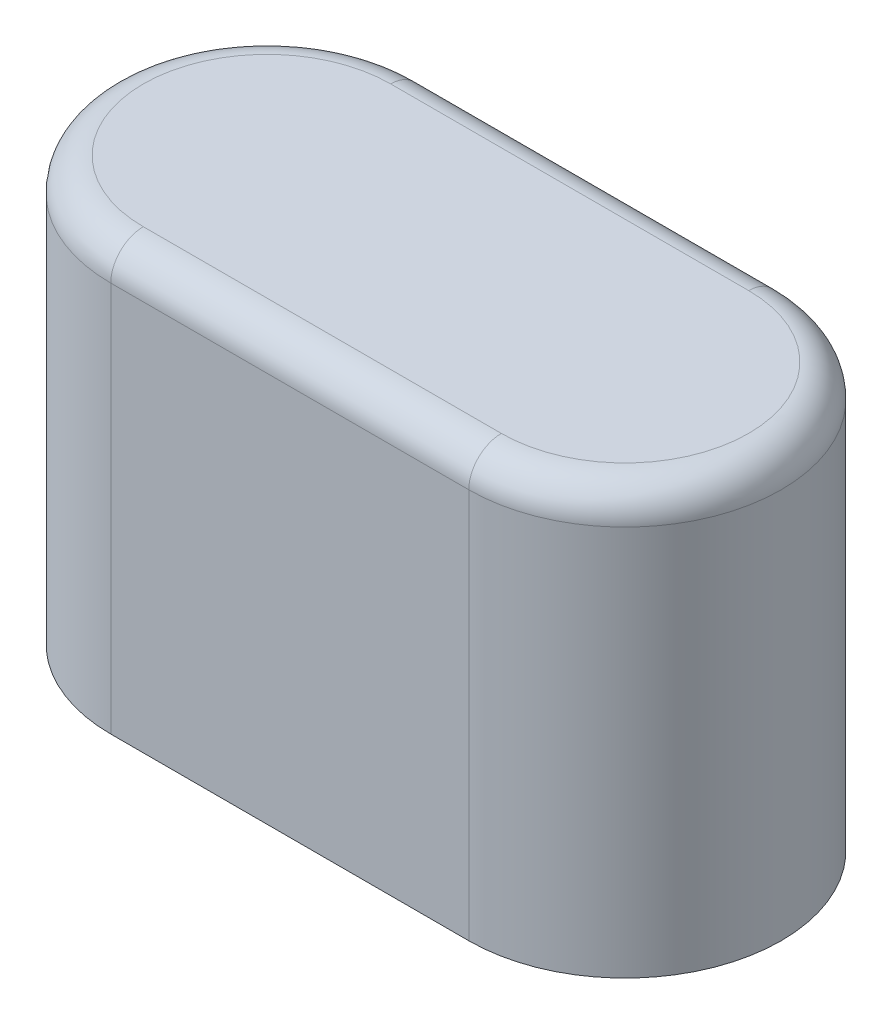
ISO-10303-21;
HEADER;
FILE_DESCRIPTION(('STEP AP214'),'2;1');
FILE_NAME('part.step','',(''),(''),'','','');
FILE_SCHEMA(('AUTOMOTIVE_DESIGN { 1 0 10303 214 1 1 1 1 }'));
ENDSEC;
DATA;
#1=APPLICATION_CONTEXT('core data for automotive mechanical design processes');
#2=APPLICATION_PROTOCOL_DEFINITION('international standard','automotive_design',2000,#1);
#3=PRODUCT_CONTEXT('',#1,'mechanical');
#4=PRODUCT('Part','Part','',(#3));
#5=PRODUCT_RELATED_PRODUCT_CATEGORY('part','',(#4));
#6=PRODUCT_DEFINITION_FORMATION('','',#4);
#7=PRODUCT_DEFINITION_CONTEXT('part definition',#1,'design');
#8=PRODUCT_DEFINITION('design','',#6,#7);
#9=PRODUCT_DEFINITION_SHAPE('','',#8);
#10=(LENGTH_UNIT() NAMED_UNIT(*) SI_UNIT(.MILLI.,.METRE.));
#11=(NAMED_UNIT(*) PLANE_ANGLE_UNIT() SI_UNIT($,.RADIAN.));
#12=(NAMED_UNIT(*) SI_UNIT($,.STERADIAN.) SOLID_ANGLE_UNIT());
#13=UNCERTAINTY_MEASURE_WITH_UNIT(LENGTH_MEASURE(1.E-05),#10,'distance_accuracy_value','');
#14=(GEOMETRIC_REPRESENTATION_CONTEXT(3) GLOBAL_UNCERTAINTY_ASSIGNED_CONTEXT((#13)) GLOBAL_UNIT_ASSIGNED_CONTEXT((#10,
#11,#12)) REPRESENTATION_CONTEXT('',''));
#15=CARTESIAN_POINT('',(0.,0.,0.));
#16=DIRECTION('',(0.,0.,1.));
#17=DIRECTION('',(1.,0.,0.));
#18=AXIS2_PLACEMENT_3D('',#15,#16,#17);
#19=CARTESIAN_POINT('',(-3.4925,8.255,0.));
#20=DIRECTION('',(0.,-1.,0.));
#21=DIRECTION('',(0.,0.,-1.));
#22=AXIS2_PLACEMENT_3D('',#19,#20,#21);
#23=CYLINDRICAL_SURFACE('',#22,3.048);
#24=DIRECTION('',(0.,-1.,0.));
#25=VECTOR('',#24,1.);
#26=CARTESIAN_POINT('',(-3.4925,8.255,3.048));
#27=LINE('',#26,#25);
#28=CARTESIAN_POINT('',(-3.4925,7.62,3.048));
#29=VERTEX_POINT('',#28);
#30=CARTESIAN_POINT('',(-3.4925,0.,3.048));
#31=VERTEX_POINT('',#30);
#32=EDGE_CURVE('E94',#29,#31,#27,.T.);
#33=ORIENTED_EDGE('',*,*,#32,.F.);
#34=CARTESIAN_POINT('',(-3.4925,7.62,0.));
#35=DIRECTION('',(0.,1.,0.));
#36=DIRECTION('',(0.,0.,1.));
#37=AXIS2_PLACEMENT_3D('',#34,#35,#36);
#38=CIRCLE('',#37,3.048);
#39=CARTESIAN_POINT('',(-3.4925,7.62,-3.048));
#40=VERTEX_POINT('',#39);
#41=EDGE_CURVE('E64',#29,#40,#38,.F.);
#42=ORIENTED_EDGE('',*,*,#41,.T.);
#43=DIRECTION('',(0.,-1.,0.));
#44=VECTOR('',#43,1.);
#45=CARTESIAN_POINT('',(-3.4925,8.255,-3.048));
#46=LINE('',#45,#44);
#47=CARTESIAN_POINT('',(-3.4925,0.,-3.048));
#48=VERTEX_POINT('',#47);
#49=EDGE_CURVE('E116',#40,#48,#46,.T.);
#50=ORIENTED_EDGE('',*,*,#49,.T.);
#51=CARTESIAN_POINT('',(-3.4925,0.,0.));
#52=DIRECTION('',(0.,1.,0.));
#53=DIRECTION('',(0.,0.,1.));
#54=AXIS2_PLACEMENT_3D('',#51,#52,#53);
#55=CIRCLE('',#54,3.048);
#56=EDGE_CURVE('E111',#48,#31,#55,.T.);
#57=ORIENTED_EDGE('',*,*,#56,.T.);
#58=EDGE_LOOP('',(#33,#42,#50,#57));
#59=FACE_BOUND('',#58,.T.);
#60=ADVANCED_FACE('F39',(#59),#23,.T.);
#61=CARTESIAN_POINT('',(-3.4925,8.255,3.048));
#62=DIRECTION('',(0.,0.,-1.));
#63=DIRECTION('',(-1.,0.,0.));
#64=AXIS2_PLACEMENT_3D('',#61,#62,#63);
#65=PLANE('',#64);
#66=DIRECTION('',(0.,-1.,0.));
#67=VECTOR('',#66,1.);
#68=CARTESIAN_POINT('',(3.4925,8.255,3.048));
#69=LINE('',#68,#67);
#70=CARTESIAN_POINT('',(3.4925,7.62,3.048));
#71=VERTEX_POINT('',#70);
#72=CARTESIAN_POINT('',(3.4925,0.,3.048));
#73=VERTEX_POINT('',#72);
#74=EDGE_CURVE('E105',#71,#73,#69,.T.);
#75=ORIENTED_EDGE('',*,*,#74,.F.);
#76=DIRECTION('',(1.,0.,0.));
#77=VECTOR('',#76,1.);
#78=CARTESIAN_POINT('',(-3.4925,7.62,3.048));
#79=LINE('',#78,#77);
#80=EDGE_CURVE('E101',#71,#29,#79,.F.);
#81=ORIENTED_EDGE('',*,*,#80,.T.);
#82=ORIENTED_EDGE('',*,*,#32,.T.);
#83=DIRECTION('',(1.,0.,0.));
#84=VECTOR('',#83,1.);
#85=CARTESIAN_POINT('',(-3.4925,0.,3.048));
#86=LINE('',#85,#84);
#87=EDGE_CURVE('E98',#31,#73,#86,.T.);
#88=ORIENTED_EDGE('',*,*,#87,.T.);
#89=EDGE_LOOP('',(#75,#81,#82,#88));
#90=FACE_BOUND('',#89,.T.);
#91=ADVANCED_FACE('F97',(#90),#65,.F.);
#92=CARTESIAN_POINT('',(3.4925,8.255,0.));
#93=DIRECTION('',(0.,-1.,0.));
#94=DIRECTION('',(0.,0.,-1.));
#95=AXIS2_PLACEMENT_3D('',#92,#93,#94);
#96=CYLINDRICAL_SURFACE('',#95,3.048);
#97=DIRECTION('',(0.,-1.,0.));
#98=VECTOR('',#97,1.);
#99=CARTESIAN_POINT('',(3.4925,8.255,-3.048));
#100=LINE('',#99,#98);
#101=CARTESIAN_POINT('',(3.4925,7.62,-3.048));
#102=VERTEX_POINT('',#101);
#103=CARTESIAN_POINT('',(3.4925,0.,-3.048));
#104=VERTEX_POINT('',#103);
#105=EDGE_CURVE('E134',#102,#104,#100,.T.);
#106=ORIENTED_EDGE('',*,*,#105,.F.);
#107=CARTESIAN_POINT('',(3.4925,7.62,0.));
#108=DIRECTION('',(0.,1.,0.));
#109=DIRECTION('',(0.,0.,1.));
#110=AXIS2_PLACEMENT_3D('',#107,#108,#109);
#111=CIRCLE('',#110,3.048);
#112=EDGE_CURVE('E11',#102,#71,#111,.F.);
#113=ORIENTED_EDGE('',*,*,#112,.T.);
#114=ORIENTED_EDGE('',*,*,#74,.T.);
#115=CARTESIAN_POINT('',(3.4925,0.,0.));
#116=DIRECTION('',(0.,1.,0.));
#117=DIRECTION('',(0.,0.,1.));
#118=AXIS2_PLACEMENT_3D('',#115,#116,#117);
#119=CIRCLE('',#118,3.048);
#120=EDGE_CURVE('E113',#73,#104,#119,.T.);
#121=ORIENTED_EDGE('',*,*,#120,.T.);
#122=EDGE_LOOP('',(#106,#113,#114,#121));
#123=FACE_BOUND('',#122,.T.);
#124=ADVANCED_FACE('F194',(#123),#96,.T.);
#125=CARTESIAN_POINT('',(-3.4925,8.255,-3.048));
#126=DIRECTION('',(0.,0.,1.));
#127=DIRECTION('',(1.,0.,0.));
#128=AXIS2_PLACEMENT_3D('',#125,#126,#127);
#129=PLANE('',#128);
#130=ORIENTED_EDGE('',*,*,#49,.F.);
#131=DIRECTION('',(-1.,0.,0.));
#132=VECTOR('',#131,1.);
#133=CARTESIAN_POINT('',(3.4925,7.62,-3.048));
#134=LINE('',#133,#132);
#135=EDGE_CURVE('E49',#40,#102,#134,.F.);
#136=ORIENTED_EDGE('',*,*,#135,.T.);
#137=ORIENTED_EDGE('',*,*,#105,.T.);
#138=DIRECTION('',(-1.,0.,0.));
#139=VECTOR('',#138,1.);
#140=CARTESIAN_POINT('',(-3.4925,0.,-3.048));
#141=LINE('',#140,#139);
#142=EDGE_CURVE('E129',#104,#48,#141,.T.);
#143=ORIENTED_EDGE('',*,*,#142,.T.);
#144=EDGE_LOOP('',(#130,#136,#137,#143));
#145=FACE_BOUND('',#144,.T.);
#146=ADVANCED_FACE('F216',(#145),#129,.F.);
#147=CARTESIAN_POINT('',(-3.4925,8.255,0.));
#148=DIRECTION('',(0.,1.,0.));
#149=DIRECTION('',(0.,0.,1.));
#150=AXIS2_PLACEMENT_3D('',#147,#148,#149);
#151=PLANE('',#150);
#152=CARTESIAN_POINT('',(-3.4925,8.255,0.));
#153=DIRECTION('',(0.,1.,0.));
#154=DIRECTION('',(0.,0.,1.));
#155=AXIS2_PLACEMENT_3D('',#152,#153,#154);
#156=CIRCLE('',#155,2.413);
#157=CARTESIAN_POINT('',(-3.4925,8.255,-2.413));
#158=VERTEX_POINT('',#157);
#159=CARTESIAN_POINT('',(-3.4925,8.255,2.413));
#160=VERTEX_POINT('',#159);
#161=EDGE_CURVE('E144',#158,#160,#156,.T.);
#162=ORIENTED_EDGE('',*,*,#161,.T.);
#163=DIRECTION('',(1.,0.,0.));
#164=VECTOR('',#163,1.);
#165=CARTESIAN_POINT('',(3.4925,8.255,2.413));
#166=LINE('',#165,#164);
#167=CARTESIAN_POINT('',(3.4925,8.255,2.413));
#168=VERTEX_POINT('',#167);
#169=EDGE_CURVE('E147',#160,#168,#166,.T.);
#170=ORIENTED_EDGE('',*,*,#169,.T.);
#171=CARTESIAN_POINT('',(3.4925,8.255,0.));
#172=DIRECTION('',(0.,1.,0.));
#173=DIRECTION('',(0.,0.,1.));
#174=AXIS2_PLACEMENT_3D('',#171,#172,#173);
#175=CIRCLE('',#174,2.413);
#176=CARTESIAN_POINT('',(3.4925,8.255,-2.413));
#177=VERTEX_POINT('',#176);
#178=EDGE_CURVE('E104',#168,#177,#175,.T.);
#179=ORIENTED_EDGE('',*,*,#178,.T.);
#180=DIRECTION('',(-1.,0.,0.));
#181=VECTOR('',#180,1.);
#182=CARTESIAN_POINT('',(-3.4925,8.255,-2.413));
#183=LINE('',#182,#181);
#184=EDGE_CURVE('E141',#177,#158,#183,.T.);
#185=ORIENTED_EDGE('',*,*,#184,.T.);
#186=EDGE_LOOP('',(#162,#170,#179,#185));
#187=FACE_BOUND('',#186,.T.);
#188=ADVANCED_FACE('F176',(#187),#151,.T.);
#189=CARTESIAN_POINT('',(-3.4925,0.,0.));
#190=DIRECTION('',(0.,1.,0.));
#191=DIRECTION('',(0.,0.,1.));
#192=AXIS2_PLACEMENT_3D('',#189,#190,#191);
#193=PLANE('',#192);
#194=CARTESIAN_POINT('',(0.,0.,0.));
#195=DIRECTION('',(0.,-1.,0.));
#196=DIRECTION('',(0.,0.,-1.));
#197=AXIS2_PLACEMENT_3D('',#194,#195,#196);
#198=CIRCLE('',#197,1.778);
#199=CARTESIAN_POINT('',(0.,0.,-1.778));
#200=VERTEX_POINT('',#199);
#201=EDGE_CURVE('E124',#200,#200,#198,.T.);
#202=ORIENTED_EDGE('',*,*,#201,.F.);
#203=EDGE_LOOP('',(#202));
#204=FACE_BOUND('',#203,.T.);
#205=ORIENTED_EDGE('',*,*,#56,.F.);
#206=ORIENTED_EDGE('',*,*,#142,.F.);
#207=ORIENTED_EDGE('',*,*,#120,.F.);
#208=ORIENTED_EDGE('',*,*,#87,.F.);
#209=EDGE_LOOP('',(#205,#206,#207,#208));
#210=FACE_BOUND('',#209,.T.);
#211=ADVANCED_FACE('F109',(#204,#210),#193,.F.);
#212=CARTESIAN_POINT('',(-3.4925,7.62,-2.413));
#213=DIRECTION('',(1.,0.,0.));
#214=DIRECTION('',(0.,0.,-1.));
#215=AXIS2_PLACEMENT_3D('',#212,#213,#214);
#216=CYLINDRICAL_SURFACE('',#215,0.635);
#217=CARTESIAN_POINT('',(3.4925,7.62,-2.413));
#218=DIRECTION('',(1.,0.,0.));
#219=DIRECTION('',(0.,0.,-1.));
#220=AXIS2_PLACEMENT_3D('',#217,#218,#219);
#221=CIRCLE('',#220,0.635);
#222=EDGE_CURVE('E122',#102,#177,#221,.T.);
#223=ORIENTED_EDGE('',*,*,#222,.F.);
#224=ORIENTED_EDGE('',*,*,#135,.F.);
#225=CARTESIAN_POINT('',(-3.4925,7.62,-2.413));
#226=DIRECTION('',(-1.,0.,0.));
#227=DIRECTION('',(0.,0.,1.));
#228=AXIS2_PLACEMENT_3D('',#225,#226,#227);
#229=CIRCLE('',#228,0.635);
#230=EDGE_CURVE('E43',#158,#40,#229,.T.);
#231=ORIENTED_EDGE('',*,*,#230,.F.);
#232=ORIENTED_EDGE('',*,*,#184,.F.);
#233=EDGE_LOOP('',(#223,#224,#231,#232));
#234=FACE_BOUND('',#233,.T.);
#235=ADVANCED_FACE('F41',(#234),#216,.T.);
#236=CARTESIAN_POINT('',(-3.4925,7.62,0.));
#237=DIRECTION('',(0.,1.,0.));
#238=DIRECTION('',(0.,0.,1.));
#239=AXIS2_PLACEMENT_3D('',#236,#237,#238);
#240=TOROIDAL_SURFACE('',#239,2.413,0.635);
#241=ORIENTED_EDGE('',*,*,#230,.T.);
#242=ORIENTED_EDGE('',*,*,#41,.F.);
#243=CARTESIAN_POINT('',(-3.4925,7.62,2.413));
#244=DIRECTION('',(1.,0.,0.));
#245=DIRECTION('',(0.,0.,-1.));
#246=AXIS2_PLACEMENT_3D('',#243,#244,#245);
#247=CIRCLE('',#246,0.635);
#248=EDGE_CURVE('E160',#160,#29,#247,.T.);
#249=ORIENTED_EDGE('',*,*,#248,.F.);
#250=ORIENTED_EDGE('',*,*,#161,.F.);
#251=EDGE_LOOP('',(#241,#242,#249,#250));
#252=FACE_BOUND('',#251,.T.);
#253=ADVANCED_FACE('F182',(#252),#240,.T.);
#254=CARTESIAN_POINT('',(3.4925,7.62,0.));
#255=DIRECTION('',(0.,1.,0.));
#256=DIRECTION('',(0.,0.,1.));
#257=AXIS2_PLACEMENT_3D('',#254,#255,#256);
#258=TOROIDAL_SURFACE('',#257,2.413,0.635);
#259=ORIENTED_EDGE('',*,*,#222,.T.);
#260=ORIENTED_EDGE('',*,*,#178,.F.);
#261=CARTESIAN_POINT('',(3.4925,7.62,2.413));
#262=DIRECTION('',(-1.,0.,0.));
#263=DIRECTION('',(0.,0.,1.));
#264=AXIS2_PLACEMENT_3D('',#261,#262,#263);
#265=CIRCLE('',#264,0.635);
#266=EDGE_CURVE('E157',#71,#168,#265,.T.);
#267=ORIENTED_EDGE('',*,*,#266,.F.);
#268=ORIENTED_EDGE('',*,*,#112,.F.);
#269=EDGE_LOOP('',(#259,#260,#267,#268));
#270=FACE_BOUND('',#269,.T.);
#271=ADVANCED_FACE('F169',(#270),#258,.T.);
#272=CARTESIAN_POINT('',(-3.4925,7.62,2.413));
#273=DIRECTION('',(-1.,0.,0.));
#274=DIRECTION('',(0.,0.,1.));
#275=AXIS2_PLACEMENT_3D('',#272,#273,#274);
#276=CYLINDRICAL_SURFACE('',#275,0.635);
#277=ORIENTED_EDGE('',*,*,#248,.T.);
#278=ORIENTED_EDGE('',*,*,#80,.F.);
#279=ORIENTED_EDGE('',*,*,#266,.T.);
#280=ORIENTED_EDGE('',*,*,#169,.F.);
#281=EDGE_LOOP('',(#277,#278,#279,#280));
#282=FACE_BOUND('',#281,.T.);
#283=ADVANCED_FACE('F180',(#282),#276,.T.);
#284=CARTESIAN_POINT('',(0.,6.985,0.));
#285=DIRECTION('',(0.,-1.,0.));
#286=DIRECTION('',(0.,0.,-1.));
#287=AXIS2_PLACEMENT_3D('',#284,#285,#286);
#288=CYLINDRICAL_SURFACE('',#287,1.778);
#289=CARTESIAN_POINT('',(0.,6.985,0.));
#290=DIRECTION('',(0.,-1.,0.));
#291=DIRECTION('',(0.,0.,-1.));
#292=AXIS2_PLACEMENT_3D('',#289,#290,#291);
#293=CIRCLE('',#292,1.778);
#294=CARTESIAN_POINT('',(0.,6.985,-1.778));
#295=VERTEX_POINT('',#294);
#296=EDGE_CURVE('E161',#295,#295,#293,.T.);
#297=ORIENTED_EDGE('',*,*,#296,.F.);
#298=EDGE_LOOP('',(#297));
#299=FACE_BOUND('',#298,.T.);
#300=ORIENTED_EDGE('',*,*,#201,.T.);
#301=EDGE_LOOP('',(#300));
#302=FACE_BOUND('',#301,.T.);
#303=ADVANCED_FACE('F199',(#299,#302),#288,.F.);
#304=CARTESIAN_POINT('',(0.,6.985,0.));
#305=DIRECTION('',(0.,-1.,0.));
#306=DIRECTION('',(0.,0.,-1.));
#307=AXIS2_PLACEMENT_3D('',#304,#305,#306);
#308=PLANE('',#307);
#309=ORIENTED_EDGE('',*,*,#296,.T.);
#310=EDGE_LOOP('',(#309));
#311=FACE_BOUND('',#310,.T.);
#312=ADVANCED_FACE('F203',(#311),#308,.T.);
#313=CLOSED_SHELL('',(#60,#91,#124,#146,#188,#211,#235,#253,#271,#283,#303,#312));
#314=MANIFOLD_SOLID_BREP('B2',#313);
#315=ADVANCED_BREP_SHAPE_REPRESENTATION('',(#18,#314),#14);
#316=SHAPE_DEFINITION_REPRESENTATION(#9,#315);
ENDSEC;
END-ISO-10303-21;
